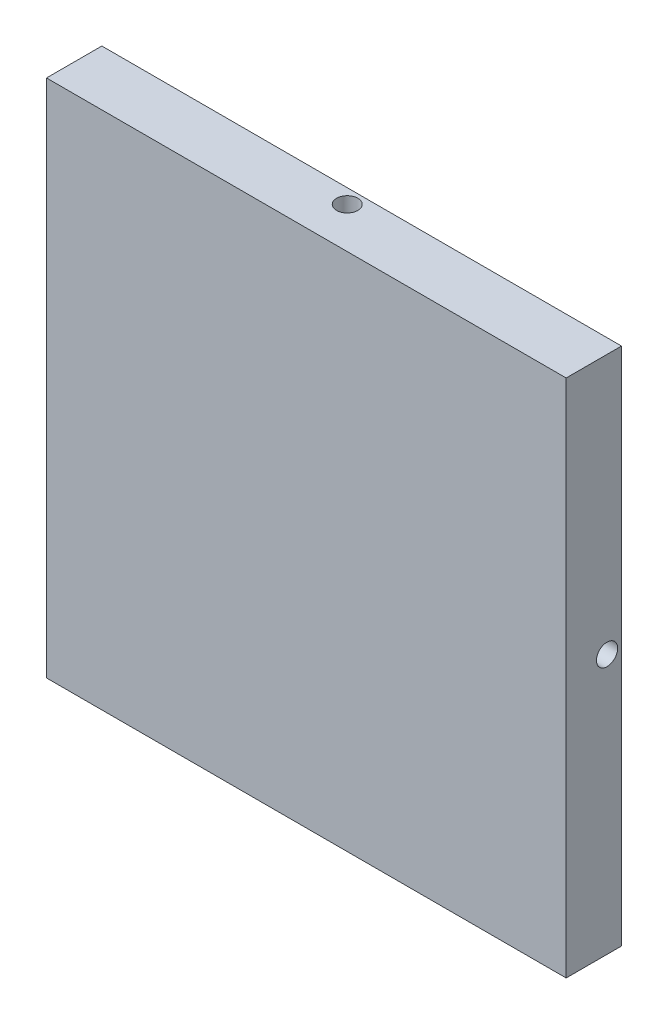
ISO-10303-21;
HEADER;
FILE_DESCRIPTION(('STEP AP214'),'2;1');
FILE_NAME('part.step','',(''),(''),'','','');
FILE_SCHEMA(('AUTOMOTIVE_DESIGN { 1 0 10303 214 1 1 1 1 }'));
ENDSEC;
DATA;
#1=APPLICATION_CONTEXT('core data for automotive mechanical design processes');
#2=APPLICATION_PROTOCOL_DEFINITION('international standard','automotive_design',2000,#1);
#3=PRODUCT_CONTEXT('',#1,'mechanical');
#4=PRODUCT('Part','Part','',(#3));
#5=PRODUCT_RELATED_PRODUCT_CATEGORY('part','',(#4));
#6=PRODUCT_DEFINITION_FORMATION('','',#4);
#7=PRODUCT_DEFINITION_CONTEXT('part definition',#1,'design');
#8=PRODUCT_DEFINITION('design','',#6,#7);
#9=PRODUCT_DEFINITION_SHAPE('','',#8);
#10=(LENGTH_UNIT() NAMED_UNIT(*) SI_UNIT(.MILLI.,.METRE.));
#11=(NAMED_UNIT(*) PLANE_ANGLE_UNIT() SI_UNIT($,.RADIAN.));
#12=(NAMED_UNIT(*) SI_UNIT($,.STERADIAN.) SOLID_ANGLE_UNIT());
#13=UNCERTAINTY_MEASURE_WITH_UNIT(LENGTH_MEASURE(1.E-05),#10,'distance_accuracy_value','');
#14=(GEOMETRIC_REPRESENTATION_CONTEXT(3) GLOBAL_UNCERTAINTY_ASSIGNED_CONTEXT((#13)) GLOBAL_UNIT_ASSIGNED_CONTEXT((#10,
#11,#12)) REPRESENTATION_CONTEXT('',''));
#15=CARTESIAN_POINT('',(0.,0.,0.));
#16=DIRECTION('',(0.,0.,1.));
#17=DIRECTION('',(1.,0.,0.));
#18=AXIS2_PLACEMENT_3D('',#15,#16,#17);
#19=CARTESIAN_POINT('',(0.,0.,0.));
#20=DIRECTION('',(0.,0.,1.));
#21=DIRECTION('',(1.,0.,0.));
#22=AXIS2_PLACEMENT_3D('',#19,#20,#21);
#23=PLANE('',#22);
#24=CARTESIAN_POINT('',(0.,0.,0.));
#25=DIRECTION('',(0.,0.,1.));
#26=DIRECTION('',(1.,0.,0.));
#27=AXIS2_PLACEMENT_3D('',#24,#25,#26);
#28=CIRCLE('',#27,3.3);
#29=CARTESIAN_POINT('',(3.3,0.,0.));
#30=VERTEX_POINT('',#29);
#31=EDGE_CURVE('E229',#30,#30,#28,.T.);
#32=ORIENTED_EDGE('',*,*,#31,.T.);
#33=EDGE_LOOP('',(#32));
#34=FACE_BOUND('',#33,.T.);
#35=CARTESIAN_POINT('',(0.,25.4,0.));
#36=DIRECTION('',(0.,0.,1.));
#37=DIRECTION('',(1.,0.,0.));
#38=AXIS2_PLACEMENT_3D('',#35,#36,#37);
#39=CIRCLE('',#38,1.54305);
#40=CARTESIAN_POINT('',(1.54305,25.4,0.));
#41=VERTEX_POINT('',#40);
#42=EDGE_CURVE('E285',#41,#41,#39,.F.);
#43=ORIENTED_EDGE('',*,*,#42,.F.);
#44=EDGE_LOOP('',(#43));
#45=FACE_BOUND('',#44,.T.);
#46=CARTESIAN_POINT('',(0.,0.,0.));
#47=DIRECTION('',(0.,0.,1.));
#48=DIRECTION('',(1.,0.,0.));
#49=AXIS2_PLACEMENT_3D('',#46,#47,#48);
#50=CIRCLE('',#49,76.99375);
#51=CARTESIAN_POINT('',(76.99375,0.,0.));
#52=VERTEX_POINT('',#51);
#53=EDGE_CURVE('E12',#52,#52,#50,.T.);
#54=ORIENTED_EDGE('',*,*,#53,.F.);
#55=EDGE_LOOP('',(#54));
#56=FACE_BOUND('',#55,.T.);
#57=ADVANCED_FACE('F54',(#34,#45,#56),#23,.F.);
#58=CARTESIAN_POINT('',(85.725,0.,8.73125));
#59=DIRECTION('',(1.,0.,0.));
#60=DIRECTION('',(0.,1.,0.));
#61=AXIS2_PLACEMENT_3D('',#58,#59,#60);
#62=PLANE('',#61);
#63=CARTESIAN_POINT('',(85.725,8.97921713316983E-13,-4.7625));
#64=DIRECTION('',(1.,0.,0.));
#65=DIRECTION('',(0.,0.,1.));
#66=AXIS2_PLACEMENT_3D('',#63,#64,#65);
#67=CIRCLE('',#66,3.5);
#68=CARTESIAN_POINT('',(85.725,8.97921713316983E-13,-1.2625));
#69=VERTEX_POINT('',#68);
#70=EDGE_CURVE('E284',#69,#69,#67,.T.);
#71=ORIENTED_EDGE('',*,*,#70,.F.);
#72=EDGE_LOOP('',(#71));
#73=FACE_BOUND('',#72,.T.);
#74=DIRECTION('',(0.,0.,-1.));
#75=VECTOR('',#74,1.);
#76=CARTESIAN_POINT('',(85.725,-85.725,8.73125));
#77=LINE('',#76,#75);
#78=CARTESIAN_POINT('',(85.725,-85.725,8.73125));
#79=VERTEX_POINT('',#78);
#80=CARTESIAN_POINT('',(85.725,-85.725,-9.525));
#81=VERTEX_POINT('',#80);
#82=EDGE_CURVE('E117',#79,#81,#77,.T.);
#83=ORIENTED_EDGE('',*,*,#82,.T.);
#84=DIRECTION('',(0.,-1.,0.));
#85=VECTOR('',#84,1.);
#86=CARTESIAN_POINT('',(85.725,0.,-9.525));
#87=LINE('',#86,#85);
#88=CARTESIAN_POINT('',(85.725,85.725,-9.525));
#89=VERTEX_POINT('',#88);
#90=EDGE_CURVE('E112',#89,#81,#87,.T.);
#91=ORIENTED_EDGE('',*,*,#90,.F.);
#92=DIRECTION('',(0.,0.,-1.));
#93=VECTOR('',#92,1.);
#94=CARTESIAN_POINT('',(85.725,85.725,8.73125));
#95=LINE('',#94,#93);
#96=CARTESIAN_POINT('',(85.725,85.725,8.73125));
#97=VERTEX_POINT('',#96);
#98=EDGE_CURVE('E96',#97,#89,#95,.T.);
#99=ORIENTED_EDGE('',*,*,#98,.F.);
#100=DIRECTION('',(0.,-1.,0.));
#101=VECTOR('',#100,1.);
#102=CARTESIAN_POINT('',(85.725,0.,8.73125));
#103=LINE('',#102,#101);
#104=EDGE_CURVE('E128',#97,#79,#103,.T.);
#105=ORIENTED_EDGE('',*,*,#104,.T.);
#106=EDGE_LOOP('',(#83,#91,#99,#105));
#107=FACE_BOUND('',#106,.T.);
#108=ADVANCED_FACE('F56',(#73,#107),#62,.T.);
#109=CARTESIAN_POINT('',(0.,85.725,8.73125));
#110=DIRECTION('',(0.,1.,0.));
#111=DIRECTION('',(0.,0.,1.));
#112=AXIS2_PLACEMENT_3D('',#109,#110,#111);
#113=PLANE('',#112);
#114=CARTESIAN_POINT('',(0.,85.725,-4.7625));
#115=DIRECTION('',(0.,1.,0.));
#116=DIRECTION('',(0.,0.,1.));
#117=AXIS2_PLACEMENT_3D('',#114,#115,#116);
#118=CIRCLE('',#117,3.5);
#119=CARTESIAN_POINT('',(0.,85.725,-1.2625));
#120=VERTEX_POINT('',#119);
#121=EDGE_CURVE('E223',#120,#120,#118,.T.);
#122=ORIENTED_EDGE('',*,*,#121,.F.);
#123=EDGE_LOOP('',(#122));
#124=FACE_BOUND('',#123,.T.);
#125=ORIENTED_EDGE('',*,*,#98,.T.);
#126=DIRECTION('',(1.,0.,0.));
#127=VECTOR('',#126,1.);
#128=CARTESIAN_POINT('',(0.,85.725,-9.525));
#129=LINE('',#128,#127);
#130=CARTESIAN_POINT('',(-85.725,85.725,-9.525));
#131=VERTEX_POINT('',#130);
#132=EDGE_CURVE('E99',#131,#89,#129,.T.);
#133=ORIENTED_EDGE('',*,*,#132,.F.);
#134=DIRECTION('',(0.,0.,-1.));
#135=VECTOR('',#134,1.);
#136=CARTESIAN_POINT('',(-85.725,85.725,8.73125));
#137=LINE('',#136,#135);
#138=CARTESIAN_POINT('',(-85.725,85.725,8.73125));
#139=VERTEX_POINT('',#138);
#140=EDGE_CURVE('E106',#139,#131,#137,.T.);
#141=ORIENTED_EDGE('',*,*,#140,.F.);
#142=DIRECTION('',(1.,0.,0.));
#143=VECTOR('',#142,1.);
#144=CARTESIAN_POINT('',(0.,85.725,8.73125));
#145=LINE('',#144,#143);
#146=EDGE_CURVE('E101',#139,#97,#145,.T.);
#147=ORIENTED_EDGE('',*,*,#146,.T.);
#148=EDGE_LOOP('',(#125,#133,#141,#147));
#149=FACE_BOUND('',#148,.T.);
#150=ADVANCED_FACE('F98',(#124,#149),#113,.T.);
#151=CARTESIAN_POINT('',(-85.7250000000003,2.84494650060197E-13,8.73125));
#152=DIRECTION('',(1.,0.,0.));
#153=DIRECTION('',(0.,1.,0.));
#154=AXIS2_PLACEMENT_3D('',#151,#152,#153);
#155=PLANE('',#154);
#156=CARTESIAN_POINT('',(-85.725,-2.99307237772328E-13,-4.7625));
#157=DIRECTION('',(-1.,0.,0.));
#158=DIRECTION('',(0.,0.,1.));
#159=AXIS2_PLACEMENT_3D('',#156,#157,#158);
#160=CIRCLE('',#159,3.5);
#161=CARTESIAN_POINT('',(-85.725,-2.99307237772328E-13,-1.2625));
#162=VERTEX_POINT('',#161);
#163=EDGE_CURVE('E232',#162,#162,#160,.T.);
#164=ORIENTED_EDGE('',*,*,#163,.F.);
#165=EDGE_LOOP('',(#164));
#166=FACE_BOUND('',#165,.T.);
#167=ORIENTED_EDGE('',*,*,#140,.T.);
#168=DIRECTION('',(0.,-1.,0.));
#169=VECTOR('',#168,1.);
#170=CARTESIAN_POINT('',(-85.7250000000003,2.84494650060197E-13,-9.525));
#171=LINE('',#170,#169);
#172=CARTESIAN_POINT('',(-85.7250000000006,-85.725,-9.525));
#173=VERTEX_POINT('',#172);
#174=EDGE_CURVE('E115',#131,#173,#171,.T.);
#175=ORIENTED_EDGE('',*,*,#174,.T.);
#176=DIRECTION('',(0.,0.,-1.));
#177=VECTOR('',#176,1.);
#178=CARTESIAN_POINT('',(-85.7250000000006,-85.725,8.73125));
#179=LINE('',#178,#177);
#180=CARTESIAN_POINT('',(-85.7250000000006,-85.725,8.73125));
#181=VERTEX_POINT('',#180);
#182=EDGE_CURVE('E134',#181,#173,#179,.T.);
#183=ORIENTED_EDGE('',*,*,#182,.F.);
#184=DIRECTION('',(0.,-1.,0.));
#185=VECTOR('',#184,1.);
#186=CARTESIAN_POINT('',(-85.7250000000003,2.84494650060197E-13,8.73125));
#187=LINE('',#186,#185);
#188=EDGE_CURVE('E74',#139,#181,#187,.T.);
#189=ORIENTED_EDGE('',*,*,#188,.F.);
#190=EDGE_LOOP('',(#167,#175,#183,#189));
#191=FACE_BOUND('',#190,.T.);
#192=ADVANCED_FACE('F208',(#166,#191),#155,.F.);
#193=CARTESIAN_POINT('',(0.,-85.725,8.73125));
#194=DIRECTION('',(0.,1.,0.));
#195=DIRECTION('',(0.,0.,1.));
#196=AXIS2_PLACEMENT_3D('',#193,#194,#195);
#197=PLANE('',#196);
#198=CARTESIAN_POINT('',(0.,-85.725,-4.7625));
#199=DIRECTION('',(0.,-1.,0.));
#200=DIRECTION('',(0.,0.,1.));
#201=AXIS2_PLACEMENT_3D('',#198,#199,#200);
#202=CIRCLE('',#201,3.5);
#203=CARTESIAN_POINT('',(0.,-85.725,-1.2625));
#204=VERTEX_POINT('',#203);
#205=EDGE_CURVE('E286',#204,#204,#202,.T.);
#206=ORIENTED_EDGE('',*,*,#205,.F.);
#207=EDGE_LOOP('',(#206));
#208=FACE_BOUND('',#207,.T.);
#209=ORIENTED_EDGE('',*,*,#182,.T.);
#210=DIRECTION('',(1.,0.,0.));
#211=VECTOR('',#210,1.);
#212=CARTESIAN_POINT('',(0.,-85.725,-9.525));
#213=LINE('',#212,#211);
#214=EDGE_CURVE('E126',#173,#81,#213,.T.);
#215=ORIENTED_EDGE('',*,*,#214,.T.);
#216=ORIENTED_EDGE('',*,*,#82,.F.);
#217=DIRECTION('',(1.,0.,0.));
#218=VECTOR('',#217,1.);
#219=CARTESIAN_POINT('',(0.,-85.725,8.73125));
#220=LINE('',#219,#218);
#221=EDGE_CURVE('E69',#181,#79,#220,.T.);
#222=ORIENTED_EDGE('',*,*,#221,.F.);
#223=EDGE_LOOP('',(#209,#215,#216,#222));
#224=FACE_BOUND('',#223,.T.);
#225=ADVANCED_FACE('F201',(#208,#224),#197,.F.);
#226=CARTESIAN_POINT('',(0.,0.,8.73125));
#227=DIRECTION('',(0.,0.,1.));
#228=DIRECTION('',(1.,0.,0.));
#229=AXIS2_PLACEMENT_3D('',#226,#227,#228);
#230=PLANE('',#229);
#231=ORIENTED_EDGE('',*,*,#104,.F.);
#232=ORIENTED_EDGE('',*,*,#146,.F.);
#233=ORIENTED_EDGE('',*,*,#188,.T.);
#234=ORIENTED_EDGE('',*,*,#221,.T.);
#235=EDGE_LOOP('',(#231,#232,#233,#234));
#236=FACE_BOUND('',#235,.T.);
#237=ADVANCED_FACE('F198',(#236),#230,.T.);
#238=CARTESIAN_POINT('',(0.,0.,-9.525));
#239=DIRECTION('',(0.,0.,1.));
#240=DIRECTION('',(1.,0.,0.));
#241=AXIS2_PLACEMENT_3D('',#238,#239,#240);
#242=CYLINDRICAL_SURFACE('',#241,76.99375);
#243=CARTESIAN_POINT('',(-76.914156948266,-3.50000000000027,-4.7625));
#244=CARTESIAN_POINT('',(-76.9141580187678,-3.49999132065777,-4.95898753348253));
#245=CARTESIAN_POINT('',(-76.914917970357,-3.48339842904328,-5.15561495356308));
#246=CARTESIAN_POINT('',(-76.9178762513476,-3.41744053891348,-5.5434470934605));
#247=CARTESIAN_POINT('',(-76.9200762818108,-3.36803678226753,-5.73464512089552));
#248=CARTESIAN_POINT('',(-76.9256649974172,-3.23787318672199,-6.1059441148263));
#249=CARTESIAN_POINT('',(-76.9290530831563,-3.15712915759317,-6.28605062350543));
#250=CARTESIAN_POINT('',(-76.9366353810167,-2.96660089214694,-6.63010408793839));
#251=CARTESIAN_POINT('',(-76.94082940103,-2.85682357406157,-6.79405488061863));
#252=CARTESIAN_POINT('',(-76.9495551280392,-2.61123875971142,-7.10133346968724));
#253=CARTESIAN_POINT('',(-76.9540870860534,-2.47541179380689,-7.24464569954161));
#254=CARTESIAN_POINT('',(-76.9629756362332,-2.18162151370581,-7.50644660473739));
#255=CARTESIAN_POINT('',(-76.9673322212825,-2.0236573023835,-7.62493427356212));
#256=CARTESIAN_POINT('',(-76.9753808755869,-1.68999865833304,-7.8337626694603));
#257=CARTESIAN_POINT('',(-76.9790726683983,-1.51429689689407,-7.92409169855795));
#258=CARTESIAN_POINT('',(-76.9853732270334,-1.15020237514232,-8.0739635019889));
#259=CARTESIAN_POINT('',(-76.9879820000077,-0.961809698631497,-8.13350647958931));
#260=CARTESIAN_POINT('',(-76.9918208811093,-0.577820447894939,-8.22007602564744));
#261=CARTESIAN_POINT('',(-76.9930519500726,-0.382228992684647,-8.247125256811));
#262=CARTESIAN_POINT('',(-76.9939999042288,0.0107219659007974,-8.26800940062272));
#263=CARTESIAN_POINT('',(-76.9937167997468,0.20808145721053,-8.26184453975814));
#264=CARTESIAN_POINT('',(-76.9916691238355,0.598812723737446,-8.21649435614746));
#265=CARTESIAN_POINT('',(-76.9899056472449,0.792187337795512,-8.17733343621612));
#266=CARTESIAN_POINT('',(-76.9850971529962,1.16961512946215,-8.06714058184974));
#267=CARTESIAN_POINT('',(-76.9820521306526,1.35366827298792,-7.99610853089125));
#268=CARTESIAN_POINT('',(-76.9750217106705,1.70730714331206,-7.82416187682907));
#269=CARTESIAN_POINT('',(-76.9710359626899,1.87688744806779,-7.72323613723414));
#270=CARTESIAN_POINT('',(-76.9625730373835,2.1967075836287,-7.49437517197528));
#271=CARTESIAN_POINT('',(-76.9580958572231,2.34694730286256,-7.36643979051026));
#272=CARTESIAN_POINT('',(-76.9491495832638,2.62396380797202,-7.08705315959855));
#273=CARTESIAN_POINT('',(-76.9446805004453,2.7507192438639,-6.93558073996141));
#274=CARTESIAN_POINT('',(-76.9362583307958,2.977004623831,-6.61349422149646));
#275=CARTESIAN_POINT('',(-76.9323052440851,3.07653456155845,-6.44288011820569));
#276=CARTESIAN_POINT('',(-76.9253611502162,3.24554167586348,-6.08734068037587));
#277=CARTESIAN_POINT('',(-76.9223701678044,3.31501807945206,-5.90241497788093));
#278=CARTESIAN_POINT('',(-76.9176885368186,3.42193182865626,-5.52350741286491));
#279=CARTESIAN_POINT('',(-76.9159978801586,3.459369373505,-5.32952560666696));
#280=CARTESIAN_POINT('',(-76.9141090392171,3.50111634276861,-4.93819818067721));
#281=CARTESIAN_POINT('',(-76.913909520574,3.50545538582025,-4.74085572676581));
#282=CARTESIAN_POINT('',(-76.9150219718644,3.48095944627295,-4.34824543875355));
#283=CARTESIAN_POINT('',(-76.9163339376809,3.4521245540365,-4.15297759900311));
#284=CARTESIAN_POINT('',(-76.9203202622321,3.36212381571632,-3.77014251731238));
#285=CARTESIAN_POINT('',(-76.9229940507761,3.30097150042986,-3.58257208797973));
#286=CARTESIAN_POINT('',(-76.9294021609269,3.14808550169469,-3.22035815109461));
#287=CARTESIAN_POINT('',(-76.9331364875908,3.05635167242357,-3.04571470518698));
#288=CARTESIAN_POINT('',(-76.9412480112563,2.84483052236912,-2.71417590418165));
#289=CARTESIAN_POINT('',(-76.9456256636979,2.72502329111081,-2.55729326323335));
#290=CARTESIAN_POINT('',(-76.9545288034614,2.46078535028823,-2.26585723526307));
#291=CARTESIAN_POINT('',(-76.959054291574,2.31635450899468,-2.13130396770448));
#292=CARTESIAN_POINT('',(-76.9677469075859,2.00684208498668,-1.888246801769));
#293=CARTESIAN_POINT('',(-76.971913770996,1.84174547761447,-1.7797620252704));
#294=CARTESIAN_POINT('',(-76.9794157249173,1.49566410231398,-1.59205202793742));
#295=CARTESIAN_POINT('',(-76.9827508185783,1.31467939455605,-1.51282669629951));
#296=CARTESIAN_POINT('',(-76.9882120796731,0.942030702671378,-1.38591798541634));
#297=CARTESIAN_POINT('',(-76.9903387174941,0.750370905728004,-1.33822233216935));
#298=CARTESIAN_POINT('',(-76.9931452505685,0.361753776650363,-1.27568667647134));
#299=CARTESIAN_POINT('',(-76.9938251521148,0.164796467562693,-1.26084653110726));
#300=CARTESIAN_POINT('',(-76.9936616153175,-0.228634767112123,-1.26444456762646));
#301=CARTESIAN_POINT('',(-76.9928195511789,-0.425108968525256,-1.28285272911951));
#302=CARTESIAN_POINT('',(-76.989709606002,-0.812174592205118,-1.35236284824809));
#303=CARTESIAN_POINT('',(-76.9874417222338,-1.00276600320808,-1.40346486847843));
#304=CARTESIAN_POINT('',(-76.9817353674682,-1.3726629202977,-1.53690625592124));
#305=CARTESIAN_POINT('',(-76.9782968840296,-1.55196830641229,-1.61924595512938));
#306=CARTESIAN_POINT('',(-76.970636230119,-1.89421063314168,-1.81281955345898));
#307=CARTESIAN_POINT('',(-76.9664140848621,-2.05714810014709,-1.92405252296302));
#308=CARTESIAN_POINT('',(-76.9576571765792,-2.36217793887485,-2.17236042438191));
#309=CARTESIAN_POINT('',(-76.9531221678774,-2.5042536486436,-2.30945581469399));
#310=CARTESIAN_POINT('',(-76.9442521199401,-2.76341600634497,-2.60559229778808));
#311=CARTESIAN_POINT('',(-76.939917130264,-2.88049648692896,-2.76463879090567));
#312=CARTESIAN_POINT('',(-76.9319335085355,-3.08639024835032,-3.1002706709212));
#313=CARTESIAN_POINT('',(-76.9282854800342,-3.17517871932492,-3.27687127435058));
#314=CARTESIAN_POINT('',(-76.9220970565002,-3.32173976624027,-3.6423562210481));
#315=CARTESIAN_POINT('',(-76.9195553504331,-3.37954907256763,-3.83122571835422));
#316=CARTESIAN_POINT('',(-76.9165409241894,-3.44730473825511,-4.14481172450808));
#317=CARTESIAN_POINT('',(-76.9156508599483,-3.46704033180776,-4.2674958694422));
#318=CARTESIAN_POINT('',(-76.9144585340124,-3.49339069996133,-4.51426806308436));
#319=CARTESIAN_POINT('',(-76.9141562719064,-3.50000548374427,-4.63835611080989));
#320=CARTESIAN_POINT('',(-76.914156948266,-3.50000000000027,-4.7625));
#321=B_SPLINE_CURVE_WITH_KNOTS('',3,(#243,#244,#245,#246,#247,#248,#249,#250,#251,#252,#253,
#254,#255,#256,#257,#258,#259,#260,#261,#262,#263,#264,#265,#266,#267,#268,#269,#270,#271,#272,
#273,#274,#275,#276,#277,#278,#279,#280,#281,#282,#283,#284,#285,#286,#287,#288,#289,#290,#291,
#292,#293,#294,#295,#296,#297,#298,#299,#300,#301,#302,#303,#304,#305,#306,#307,#308,#309,#310,
#311,#312,#313,#314,#315,#316,#317,#318,#319,#320),.UNSPECIFIED.,.T.,.F.,(4,2,2,2,2,2,2,2,2,2,2,
2,2,2,2,2,2,2,2,2,2,2,2,2,2,2,2,2,2,2,2,2,2,2,2,2,2,2,4),(0.,0.589009436150271,1.1787158854926,
1.76812524002841,2.35739427279382,2.94710545681045,3.5368405461571,4.12682030433559,
4.71679616708067,5.30636031286248,5.89592043840481,6.48504492673186,7.07417156896335,
7.66351795902476,8.25286774873554,8.84275072566909,9.43263384013677,10.0225321257334,
10.6124267430305,11.2017934232481,11.7911584980936,12.3802770103085,12.9693983316683,
13.5589387464825,14.1484823152685,14.738457017616,15.3284294857465,15.9181721515313,
16.507912252081,17.0971201336986,17.6863291434017,18.2755444154244,18.8647407322739,
19.4544051006683,20.0442147957289,20.6345402930252,21.2241643147176,21.5963099264451,
21.9684552777422),.UNSPECIFIED.);
#322=CARTESIAN_POINT('',(-76.914156948266,-3.50000000000027,-4.7625));
#323=VERTEX_POINT('',#322);
#324=EDGE_CURVE('E295',#323,#323,#321,.T.);
#325=ORIENTED_EDGE('',*,*,#324,.F.);
#326=EDGE_LOOP('',(#325));
#327=FACE_BOUND('',#326,.T.);
#328=CARTESIAN_POINT('',(0.,-76.99375,-8.2625));
#329=CARTESIAN_POINT('',(-0.196487651769927,-76.9937489336414,-8.26249132076501));
#330=CARTESIAN_POINT('',(-0.39311518973328,-76.9929897876186,-8.24589840984841));
#331=CARTESIAN_POINT('',(-0.780947574573524,-76.9900343843276,-8.17994043607369));
#332=CARTESIAN_POINT('',(-0.972145729160827,-76.9878364275152,-8.13053661548508));
#333=CARTESIAN_POINT('',(-1.3434449918635,-76.98225221267,-8.00037283285575));
#334=CARTESIAN_POINT('',(-1.52355164108511,-76.9788665537458,-7.91962867753443));
#335=CARTESIAN_POINT('',(-1.86760534063254,-76.9712884008879,-7.72910011498888));
#336=CARTESIAN_POINT('',(-2.03155622806305,-76.9670960992393,-7.61932262631008));
#337=CARTESIAN_POINT('',(-2.33883470862715,-76.9583723567241,-7.37373764026799));
#338=CARTESIAN_POINT('',(-2.48214676559997,-76.9538406642368,-7.23791071131443));
#339=CARTESIAN_POINT('',(-2.74394733756454,-76.9449510682711,-6.94412057749942));
#340=CARTESIAN_POINT('',(-2.86243484551011,-76.9405931718489,-6.786156475043));
#341=CARTESIAN_POINT('',(-3.07126307435566,-76.9325408876182,-6.45249792487207));
#342=CARTESIAN_POINT('',(-3.1615920674035,-76.9288467765429,-6.2767961297399));
#343=CARTESIAN_POINT('',(-3.31146379486844,-76.9225415958037,-5.91270153472014));
#344=CARTESIAN_POINT('',(-3.37100673299023,-76.9199305189736,-5.72430881881494));
#345=CARTESIAN_POINT('',(-3.45757619480471,-76.9160880573694,-5.34031945357451));
#346=CARTESIAN_POINT('',(-3.48462537834873,-76.9148557111648,-5.14472792262162));
#347=CARTESIAN_POINT('',(-3.50550940068443,-76.9139067881954,-4.75177681618606));
#348=CARTESIAN_POINT('',(-3.49934446646544,-76.9141902010718,-4.55441725279554));
#349=CARTESIAN_POINT('',(-3.45399416799496,-76.9162399423221,-4.16368631320135));
#350=CARTESIAN_POINT('',(-3.4148332803641,-76.9180051714711,-3.97031208954706));
#351=CARTESIAN_POINT('',(-3.30464062642467,-76.9228178460899,-3.5928850620537));
#352=CARTESIAN_POINT('',(-3.23360874287336,-76.9258652962766,-3.4088322925079));
#353=CARTESIAN_POINT('',(-3.06166243278827,-76.9329001902832,-3.055193870551));
#354=CARTESIAN_POINT('',(-2.96073683026662,-76.9368879855442,-2.88561365941016));
#355=CARTESIAN_POINT('',(-2.73187615615057,-76.9453537243885,-2.5657936526938));
#356=CARTESIAN_POINT('',(-2.60394092884146,-76.9498316707974,-2.41555396862749));
#357=CARTESIAN_POINT('',(-2.32455440571348,-76.9587778671952,-2.13853728462855));
#358=CARTESIAN_POINT('',(-2.17308190863526,-76.9632461047229,-2.01178166593885));
#359=CARTESIAN_POINT('',(-1.85099517066974,-76.9716653349139,-1.78549595428294));
#360=CARTESIAN_POINT('',(-1.68038092557689,-76.9756163274635,-1.68596586729834));
#361=CARTESIAN_POINT('',(-1.32484145268337,-76.9825558970256,-1.51695864618532));
#362=CARTESIAN_POINT('',(-1.13991587914235,-76.9855444507781,-1.4474822383763));
#363=CARTESIAN_POINT('',(-0.761008593916654,-76.9902219620002,-1.34056844106828));
#364=CARTESIAN_POINT('',(-0.567026938339531,-76.9919109275204,-1.30313085309841));
#365=CARTESIAN_POINT('',(-0.175699577059006,-76.9937978691749,-1.26138372173322));
#366=CARTESIAN_POINT('',(0.0216429671507847,-76.993997176501,-1.2570446007354));
#367=CARTESIAN_POINT('',(0.41425345460241,-76.992885870594,-1.28154041663555));
#368=CARTESIAN_POINT('',(0.60952140349428,-76.991575261474,-1.31037526316281));
#369=CARTESIAN_POINT('',(0.992357001011033,-76.9875926211186,-1.40037601936471));
#370=CARTESIAN_POINT('',(1.17992782619126,-76.9849211577311,-1.46152844418228));
#371=CARTESIAN_POINT('',(1.54214250616481,-76.9785176495546,-1.61441479488659));
#372=CARTESIAN_POINT('',(1.7167862995838,-76.9747855997306,-1.706148865956));
#373=CARTESIAN_POINT('',(2.0483253290881,-76.9666775956911,-1.91767036719018));
#374=CARTESIAN_POINT('',(2.20520789028631,-76.9623011867038,-2.03747764630226));
#375=CARTESIAN_POINT('',(2.49664373498858,-76.9533989467459,-2.30171563787195));
#376=CARTESIAN_POINT('',(2.63119689868967,-76.9488731149737,-2.44614648243289));
#377=CARTESIAN_POINT('',(2.87425385197252,-76.9401783745866,-2.75565885942878));
#378=CARTESIAN_POINT('',(2.98273851994399,-76.9360097294066,-2.92075541627084));
#379=CARTESIAN_POINT('',(3.17044832660646,-76.9285035539568,-3.26683666268606));
#380=CARTESIAN_POINT('',(3.24967357609726,-76.9251660205397,-3.44782129209093));
#381=CARTESIAN_POINT('',(3.37658222999273,-76.9197002903658,-3.82047004300681));
#382=CARTESIAN_POINT('',(3.42427787288004,-76.9175716244221,-4.01212998944457));
#383=CARTESIAN_POINT('',(3.4868134571614,-76.9147623399943,-4.4007474328554));
#384=CARTESIAN_POINT('',(3.50165354225943,-76.9140817151768,-4.59770490665426));
#385=CARTESIAN_POINT('',(3.49805533498089,-76.9142454287087,-4.99113602838783));
#386=CARTESIAN_POINT('',(3.47964713467515,-76.9150883881061,-5.18760995282317));
#387=CARTESIAN_POINT('',(3.41013703559858,-76.9182013459072,-5.57467501315918));
#388=CARTESIAN_POINT('',(3.35903507373563,-76.9204713470648,-5.76526613770653));
#389=CARTESIAN_POINT('',(3.22559390549767,-76.9261822319299,-6.13516249853074));
#390=CARTESIAN_POINT('',(3.14325436713979,-76.9296231280813,-6.31446761483992));
#391=CARTESIAN_POINT('',(2.94968117361792,-76.9372878463498,-6.65670946944156));
#392=CARTESIAN_POINT('',(2.83844844778014,-76.9415116432843,-6.81964673395914));
#393=CARTESIAN_POINT('',(2.59014080875463,-76.9502703818598,-7.12467659788702));
#394=CARTESIAN_POINT('',(2.45304538185076,-76.9548055686596,-7.26675249034524));
#395=CARTESIAN_POINT('',(2.1569087511986,-76.9636744105775,-7.52591519948604));
#396=CARTESIAN_POINT('',(1.99786214750964,-76.9680080157553,-7.6429958492899));
#397=CARTESIAN_POINT('',(1.66223018315039,-76.9759879060417,-7.84888978646669));
#398=CARTESIAN_POINT('',(1.48562962561842,-76.9796335875458,-7.93767829608269));
#399=CARTESIAN_POINT('',(1.12014477736413,-76.9858173952855,-8.08423942808179));
#400=CARTESIAN_POINT('',(0.931275332348519,-76.9883568324445,-8.14204878024237));
#401=CARTESIAN_POINT('',(0.617689202938774,-76.9913684248902,-8.20980457916367));
#402=CARTESIAN_POINT('',(0.495004873048069,-76.9922576041775,-8.22954023255729));
#403=CARTESIAN_POINT('',(0.248232308586499,-76.9934487283989,-8.25589068024084));
#404=CARTESIAN_POINT('',(0.124144074994749,-76.9937506737426,-8.26250548368098));
#405=CARTESIAN_POINT('',(0.,-76.99375,-8.2625));
#406=B_SPLINE_CURVE_WITH_KNOTS('',3,(#328,#329,#330,#331,#332,#333,#334,#335,#336,#337,#338,
#339,#340,#341,#342,#343,#344,#345,#346,#347,#348,#349,#350,#351,#352,#353,#354,#355,#356,#357,
#358,#359,#360,#361,#362,#363,#364,#365,#366,#367,#368,#369,#370,#371,#372,#373,#374,#375,#376,
#377,#378,#379,#380,#381,#382,#383,#384,#385,#386,#387,#388,#389,#390,#391,#392,#393,#394,#395,
#396,#397,#398,#399,#400,#401,#402,#403,#404,#405),.UNSPECIFIED.,.T.,.F.,(4,2,2,2,2,2,2,2,2,2,2,
2,2,2,2,2,2,2,2,2,2,2,2,2,2,2,2,2,2,2,2,2,2,2,2,2,2,2,4),(0.,0.589009791392292,1.17871658823794,
1.76812634795735,2.3573957796733,2.94710649899128,3.53684113620523,4.12682106719472,
4.71679709436413,5.30636145644826,5.8959217893827,6.48504516713285,7.07417071208879,
7.66351678458299,8.25286625484211,8.84274969382153,9.4326332624019,10.0225310861407,
10.6124252556133,11.2017922193512,11.7911575775719,12.3802772107008,12.9693996406437,
13.5589398687035,14.148483259696,14.7384577780201,15.328430062201,15.9181732089898,
16.5079137763488,17.0971208538518,17.686329068405,18.2755435450485,18.864739072427,
19.4544039165713,20.0442140763609,20.6345393707559,21.2241632012822,21.5963093695044,
21.9684552781993),.UNSPECIFIED.);
#407=CARTESIAN_POINT('',(0.,-76.99375,-8.2625));
#408=VERTEX_POINT('',#407);
#409=EDGE_CURVE('E289',#408,#408,#406,.T.);
#410=ORIENTED_EDGE('',*,*,#409,.F.);
#411=EDGE_LOOP('',(#410));
#412=FACE_BOUND('',#411,.T.);
#413=CARTESIAN_POINT('',(76.914156948266,3.50000000000081,-4.7625));
#414=CARTESIAN_POINT('',(76.9141580187677,3.49999132065831,-4.95898753348253));
#415=CARTESIAN_POINT('',(76.914917970357,3.48339842904382,-5.15561495356308));
#416=CARTESIAN_POINT('',(76.9178762513476,3.41744053891402,-5.5434470934605));
#417=CARTESIAN_POINT('',(76.9200762818108,3.36803678226807,-5.73464512089552));
#418=CARTESIAN_POINT('',(76.9256649974172,3.23787318672253,-6.1059441148263));
#419=CARTESIAN_POINT('',(76.9290530831563,3.15712915759371,-6.28605062350544));
#420=CARTESIAN_POINT('',(76.9366353810167,2.96660089214748,-6.6301040879384));
#421=CARTESIAN_POINT('',(76.94082940103,2.8568235740621,-6.79405488061863));
#422=CARTESIAN_POINT('',(76.9495551280392,2.61123875971195,-7.10133346968724));
#423=CARTESIAN_POINT('',(76.9540870860534,2.47541179380743,-7.24464569954162));
#424=CARTESIAN_POINT('',(76.9629756362332,2.18162151370635,-7.50644660473739));
#425=CARTESIAN_POINT('',(76.9673322212825,2.02365730238404,-7.62493427356212));
#426=CARTESIAN_POINT('',(76.9753808755869,1.68999865833358,-7.8337626694603));
#427=CARTESIAN_POINT('',(76.9790726683983,1.51429689689461,-7.92409169855795));
#428=CARTESIAN_POINT('',(76.9853732270334,1.15020237514285,-8.0739635019889));
#429=CARTESIAN_POINT('',(76.9879820000077,0.961809698632033,-8.13350647958931));
#430=CARTESIAN_POINT('',(76.9918208811093,0.577820447895476,-8.22007602564744));
#431=CARTESIAN_POINT('',(76.9930519500726,0.382228992685184,-8.247125256811));
#432=CARTESIAN_POINT('',(76.9939999042288,-0.0107219659002607,-8.26800940062272));
#433=CARTESIAN_POINT('',(76.9937167997468,-0.208081457209994,-8.26184453975814));
#434=CARTESIAN_POINT('',(76.9916691238355,-0.59881272373691,-8.21649435614746));
#435=CARTESIAN_POINT('',(76.9899056472449,-0.792187337794976,-8.17733343621612));
#436=CARTESIAN_POINT('',(76.9850971529962,-1.16961512946161,-8.06714058184974));
#437=CARTESIAN_POINT('',(76.9820521306526,-1.35366827298739,-7.99610853089125));
#438=CARTESIAN_POINT('',(76.9750217106705,-1.70730714331152,-7.82416187682907));
#439=CARTESIAN_POINT('',(76.97103596269,-1.87688744806726,-7.72323613723414));
#440=CARTESIAN_POINT('',(76.9625730373836,-2.19670758362817,-7.49437517197527));
#441=CARTESIAN_POINT('',(76.9580958572231,-2.34694730286203,-7.36643979051025));
#442=CARTESIAN_POINT('',(76.9491495832638,-2.62396380797148,-7.08705315959855));
#443=CARTESIAN_POINT('',(76.9446805004453,-2.75071924386336,-6.93558073996141));
#444=CARTESIAN_POINT('',(76.9362583307958,-2.97700462383046,-6.61349422149646));
#445=CARTESIAN_POINT('',(76.9323052440851,-3.07653456155792,-6.44288011820569));
#446=CARTESIAN_POINT('',(76.9253611502163,-3.24554167586294,-6.08734068037587));
#447=CARTESIAN_POINT('',(76.9223701678044,-3.31501807945152,-5.90241497788093));
#448=CARTESIAN_POINT('',(76.9176885368186,-3.42193182865573,-5.52350741286491));
#449=CARTESIAN_POINT('',(76.9159978801587,-3.45936937350447,-5.32952560666696));
#450=CARTESIAN_POINT('',(76.9141090392171,-3.50111634276808,-4.93819818067721));
#451=CARTESIAN_POINT('',(76.913909520574,-3.50545538581971,-4.74085572676581));
#452=CARTESIAN_POINT('',(76.9150219718644,-3.48095944627241,-4.34824543875355));
#453=CARTESIAN_POINT('',(76.9163339376809,-3.45212455403596,-4.15297759900311));
#454=CARTESIAN_POINT('',(76.9203202622321,-3.36212381571578,-3.77014251731237));
#455=CARTESIAN_POINT('',(76.9229940507761,-3.30097150042933,-3.58257208797973));
#456=CARTESIAN_POINT('',(76.929402160927,-3.14808550169416,-3.22035815109461));
#457=CARTESIAN_POINT('',(76.9331364875908,-3.05635167242303,-3.04571470518698));
#458=CARTESIAN_POINT('',(76.9412480112563,-2.84483052236859,-2.71417590418165));
#459=CARTESIAN_POINT('',(76.945625663698,-2.72502329111027,-2.55729326323335));
#460=CARTESIAN_POINT('',(76.9545288034614,-2.46078535028769,-2.26585723526307));
#461=CARTESIAN_POINT('',(76.959054291574,-2.31635450899415,-2.13130396770448));
#462=CARTESIAN_POINT('',(76.9677469075859,-2.00684208498614,-1.88824680176899));
#463=CARTESIAN_POINT('',(76.971913770996,-1.84174547761394,-1.7797620252704));
#464=CARTESIAN_POINT('',(76.9794157249173,-1.49566410231344,-1.59205202793742));
#465=CARTESIAN_POINT('',(76.9827508185783,-1.31467939455552,-1.51282669629951));
#466=CARTESIAN_POINT('',(76.988212079673,-0.942030702670842,-1.38591798541634));
#467=CARTESIAN_POINT('',(76.9903387174941,-0.750370905727468,-1.33822233216935));
#468=CARTESIAN_POINT('',(76.9931452505685,-0.361753776649827,-1.27568667647134));
#469=CARTESIAN_POINT('',(76.9938251521148,-0.164796467562156,-1.26084653110726));
#470=CARTESIAN_POINT('',(76.9936616153175,0.228634767112662,-1.26444456762646));
#471=CARTESIAN_POINT('',(76.9928195511789,0.425108968525794,-1.28285272911951));
#472=CARTESIAN_POINT('',(76.989709606002,0.812174592205656,-1.35236284824809));
#473=CARTESIAN_POINT('',(76.9874417222338,1.00276600320861,-1.40346486847843));
#474=CARTESIAN_POINT('',(76.9817353674682,1.37266292029824,-1.53690625592124));
#475=CARTESIAN_POINT('',(76.9782968840295,1.55196830641283,-1.61924595512938));
#476=CARTESIAN_POINT('',(76.970636230119,1.89421063314222,-1.81281955345898));
#477=CARTESIAN_POINT('',(76.9664140848621,2.05714810014762,-1.92405252296302));
#478=CARTESIAN_POINT('',(76.9576571765792,2.36217793887539,-2.17236042438191));
#479=CARTESIAN_POINT('',(76.9531221678773,2.50425364864414,-2.30945581469399));
#480=CARTESIAN_POINT('',(76.9442521199401,2.76341600634551,-2.60559229778808));
#481=CARTESIAN_POINT('',(76.9399171302639,2.88049648692949,-2.76463879090567));
#482=CARTESIAN_POINT('',(76.9319335085355,3.08639024835086,-3.1002706709212));
#483=CARTESIAN_POINT('',(76.9282854800341,3.17517871932545,-3.27687127435058));
#484=CARTESIAN_POINT('',(76.9220970565001,3.3217397662408,-3.6423562210481));
#485=CARTESIAN_POINT('',(76.9195553504331,3.37954907256817,-3.83122571835422));
#486=CARTESIAN_POINT('',(76.9165409241894,3.44730473825564,-4.14481172450808));
#487=CARTESIAN_POINT('',(76.9156508599482,3.4670403318083,-4.2674958694422));
#488=CARTESIAN_POINT('',(76.9144585340124,3.49339069996187,-4.51426806308436));
#489=CARTESIAN_POINT('',(76.9141562719063,3.50000548374481,-4.63835611080989));
#490=CARTESIAN_POINT('',(76.914156948266,3.50000000000081,-4.7625));
#491=B_SPLINE_CURVE_WITH_KNOTS('',3,(#413,#414,#415,#416,#417,#418,#419,#420,#421,#422,#423,
#424,#425,#426,#427,#428,#429,#430,#431,#432,#433,#434,#435,#436,#437,#438,#439,#440,#441,#442,
#443,#444,#445,#446,#447,#448,#449,#450,#451,#452,#453,#454,#455,#456,#457,#458,#459,#460,#461,
#462,#463,#464,#465,#466,#467,#468,#469,#470,#471,#472,#473,#474,#475,#476,#477,#478,#479,#480,
#481,#482,#483,#484,#485,#486,#487,#488,#489,#490),.UNSPECIFIED.,.T.,.F.,(4,2,2,2,2,2,2,2,2,2,2,
2,2,2,2,2,2,2,2,2,2,2,2,2,2,2,2,2,2,2,2,2,2,2,2,2,2,2,4),(0.,0.589009436150272,1.1787158854926,
1.76812524002841,2.35739427279382,2.94710545681046,3.5368405461571,4.12682030433559,
4.71679616708067,5.30636031286248,5.89592043840482,6.48504492673187,7.07417156896336,
7.66351795902476,8.25286774873555,8.84275072566909,9.43263384013677,10.0225321257334,
10.6124267430305,11.2017934232481,11.7911584980936,12.3802770103085,12.9693983316684,
13.5589387464825,14.1484823152685,14.738457017616,15.3284294857465,15.9181721515313,
16.507912252081,17.0971201336986,17.6863291434017,18.2755444154244,18.8647407322739,
19.4544051006683,20.0442147957289,20.6345402930252,21.2241643147176,21.5963099264451,
21.9684552777422),.UNSPECIFIED.);
#492=CARTESIAN_POINT('',(76.914156948266,3.50000000000081,-4.7625));
#493=VERTEX_POINT('',#492);
#494=EDGE_CURVE('E278',#493,#493,#491,.T.);
#495=ORIENTED_EDGE('',*,*,#494,.F.);
#496=EDGE_LOOP('',(#495));
#497=FACE_BOUND('',#496,.T.);
#498=CARTESIAN_POINT('',(0.,76.99375,-1.2625));
#499=CARTESIAN_POINT('',(-0.196487651769927,76.9937489336414,-1.26250867923499));
#500=CARTESIAN_POINT('',(-0.393115189733279,76.9929897876186,-1.27910159015159));
#501=CARTESIAN_POINT('',(-0.780947574573524,76.9900343843276,-1.34505956392631));
#502=CARTESIAN_POINT('',(-0.972145729160826,76.9878364275152,-1.39446338451492));
#503=CARTESIAN_POINT('',(-1.3434449918635,76.98225221267,-1.52462716714425));
#504=CARTESIAN_POINT('',(-1.52355164108511,76.9788665537458,-1.60537132246557));
#505=CARTESIAN_POINT('',(-1.86760534063254,76.9712884008879,-1.79589988501112));
#506=CARTESIAN_POINT('',(-2.03155622806305,76.9670960992393,-1.90567737368992));
#507=CARTESIAN_POINT('',(-2.33883470862715,76.9583723567241,-2.15126235973201));
#508=CARTESIAN_POINT('',(-2.48214676559997,76.9538406642368,-2.28708928868557));
#509=CARTESIAN_POINT('',(-2.74394733756454,76.9449510682711,-2.58087942250058));
#510=CARTESIAN_POINT('',(-2.86243484551011,76.9405931718489,-2.738843524957));
#511=CARTESIAN_POINT('',(-3.07126307435566,76.9325408876182,-3.07250207512794));
#512=CARTESIAN_POINT('',(-3.1615920674035,76.9288467765429,-3.2482038702601));
#513=CARTESIAN_POINT('',(-3.31146379486844,76.9225415958037,-3.61229846527987));
#514=CARTESIAN_POINT('',(-3.37100673299023,76.9199305189736,-3.80069118118506));
#515=CARTESIAN_POINT('',(-3.45757619480471,76.9160880573694,-4.18468054642549));
#516=CARTESIAN_POINT('',(-3.48462537834873,76.9148557111648,-4.38027207737838));
#517=CARTESIAN_POINT('',(-3.50550940068443,76.9139067881954,-4.77322318381394));
#518=CARTESIAN_POINT('',(-3.49934446646544,76.9141902010718,-4.97058274720446));
#519=CARTESIAN_POINT('',(-3.45399416799496,76.9162399423221,-5.36131368679866));
#520=CARTESIAN_POINT('',(-3.4148332803641,76.9180051714711,-5.55468791045294));
#521=CARTESIAN_POINT('',(-3.30464062642467,76.9228178460899,-5.93211493794631));
#522=CARTESIAN_POINT('',(-3.23360874287336,76.9258652962766,-6.1161677074921));
#523=CARTESIAN_POINT('',(-3.06166243278827,76.9329001902832,-6.469806129449));
#524=CARTESIAN_POINT('',(-2.96073683026662,76.9368879855442,-6.63938634058985));
#525=CARTESIAN_POINT('',(-2.73187615615057,76.9453537243885,-6.9592063473062));
#526=CARTESIAN_POINT('',(-2.60394092884146,76.9498316707974,-7.10944603137251));
#527=CARTESIAN_POINT('',(-2.32455440571348,76.9587778671952,-7.38646271537145));
#528=CARTESIAN_POINT('',(-2.17308190863526,76.9632461047229,-7.51321833406115));
#529=CARTESIAN_POINT('',(-1.85099517066974,76.9716653349139,-7.73950404571706));
#530=CARTESIAN_POINT('',(-1.68038092557689,76.9756163274635,-7.83903413270165));
#531=CARTESIAN_POINT('',(-1.32484145268337,76.9825558970256,-8.00804135381468));
#532=CARTESIAN_POINT('',(-1.13991587914235,76.9855444507781,-8.0775177616237));
#533=CARTESIAN_POINT('',(-0.761008593916653,76.9902219620002,-8.18443155893172));
#534=CARTESIAN_POINT('',(-0.56702693833953,76.9919109275204,-8.22186914690159));
#535=CARTESIAN_POINT('',(-0.175699577059006,76.9937978691749,-8.26361627826678));
#536=CARTESIAN_POINT('',(0.0216429671507853,76.993997176501,-8.2679553992646));
#537=CARTESIAN_POINT('',(0.41425345460241,76.992885870594,-8.24345958336445));
#538=CARTESIAN_POINT('',(0.60952140349428,76.991575261474,-8.21462473683719));
#539=CARTESIAN_POINT('',(0.992357001011033,76.9875926211186,-8.12462398063529));
#540=CARTESIAN_POINT('',(1.17992782619126,76.9849211577311,-8.06347155581772));
#541=CARTESIAN_POINT('',(1.54214250616481,76.9785176495546,-7.91058520511341));
#542=CARTESIAN_POINT('',(1.7167862995838,76.9747855997306,-7.818851134044));
#543=CARTESIAN_POINT('',(2.0483253290881,76.9666775956911,-7.60732963280982));
#544=CARTESIAN_POINT('',(2.20520789028631,76.9623011867038,-7.48752235369774));
#545=CARTESIAN_POINT('',(2.49664373498858,76.9533989467459,-7.22328436212806));
#546=CARTESIAN_POINT('',(2.63119689868967,76.9488731149737,-7.07885351756711));
#547=CARTESIAN_POINT('',(2.87425385197252,76.9401783745866,-6.76934114057122));
#548=CARTESIAN_POINT('',(2.98273851994399,76.9360097294066,-6.60424458372916));
#549=CARTESIAN_POINT('',(3.17044832660645,76.9285035539568,-6.25816333731394));
#550=CARTESIAN_POINT('',(3.24967357609726,76.9251660205397,-6.07717870790907));
#551=CARTESIAN_POINT('',(3.37658222999273,76.9197002903658,-5.70452995699319));
#552=CARTESIAN_POINT('',(3.42427787288005,76.9175716244221,-5.51287001055543));
#553=CARTESIAN_POINT('',(3.4868134571614,76.9147623399943,-5.1242525671446));
#554=CARTESIAN_POINT('',(3.50165354225943,76.9140817151768,-4.92729509334574));
#555=CARTESIAN_POINT('',(3.49805533498089,76.9142454287087,-4.53386397161217));
#556=CARTESIAN_POINT('',(3.47964713467515,76.9150883881061,-4.33739004717683));
#557=CARTESIAN_POINT('',(3.41013703559858,76.9182013459072,-3.95032498684083));
#558=CARTESIAN_POINT('',(3.35903507373563,76.9204713470648,-3.75973386229347));
#559=CARTESIAN_POINT('',(3.22559390549767,76.9261822319299,-3.38983750146926));
#560=CARTESIAN_POINT('',(3.14325436713979,76.9296231280813,-3.21053238516008));
#561=CARTESIAN_POINT('',(2.94968117361792,76.9372878463498,-2.86829053055844));
#562=CARTESIAN_POINT('',(2.83844844778014,76.9415116432843,-2.70535326604086));
#563=CARTESIAN_POINT('',(2.59014080875463,76.9502703818598,-2.40032340211298));
#564=CARTESIAN_POINT('',(2.45304538185076,76.9548055686596,-2.25824750965476));
#565=CARTESIAN_POINT('',(2.1569087511986,76.9636744105775,-1.99908480051396));
#566=CARTESIAN_POINT('',(1.99786214750964,76.9680080157553,-1.8820041507101));
#567=CARTESIAN_POINT('',(1.66223018315039,76.9759879060417,-1.67611021353331));
#568=CARTESIAN_POINT('',(1.48562962561842,76.9796335875458,-1.58732170391731));
#569=CARTESIAN_POINT('',(1.12014477736413,76.9858173952855,-1.44076057191821));
#570=CARTESIAN_POINT('',(0.931275332348519,76.9883568324445,-1.38295121975763));
#571=CARTESIAN_POINT('',(0.617689202938773,76.9913684248902,-1.31519542083633));
#572=CARTESIAN_POINT('',(0.495004873048067,76.9922576041775,-1.2954597674427));
#573=CARTESIAN_POINT('',(0.248232308586497,76.9934487283989,-1.26910931975916));
#574=CARTESIAN_POINT('',(0.124144074994748,76.9937506737426,-1.26249451631902));
#575=CARTESIAN_POINT('',(0.,76.99375,-1.2625));
#576=B_SPLINE_CURVE_WITH_KNOTS('',3,(#498,#499,#500,#501,#502,#503,#504,#505,#506,#507,#508,
#509,#510,#511,#512,#513,#514,#515,#516,#517,#518,#519,#520,#521,#522,#523,#524,#525,#526,#527,
#528,#529,#530,#531,#532,#533,#534,#535,#536,#537,#538,#539,#540,#541,#542,#543,#544,#545,#546,
#547,#548,#549,#550,#551,#552,#553,#554,#555,#556,#557,#558,#559,#560,#561,#562,#563,#564,#565,
#566,#567,#568,#569,#570,#571,#572,#573,#574,#575),.UNSPECIFIED.,.T.,.F.,(4,2,2,2,2,2,2,2,2,2,2,
2,2,2,2,2,2,2,2,2,2,2,2,2,2,2,2,2,2,2,2,2,2,2,2,2,2,2,4),(0.,0.589009791392292,1.17871658823794,
1.76812634795735,2.3573957796733,2.94710649899128,3.53684113620523,4.12682106719472,
4.71679709436413,5.30636145644826,5.8959217893827,6.48504516713285,7.07417071208879,
7.66351678458299,8.25286625484211,8.84274969382153,9.4326332624019,10.0225310861407,
10.6124252556133,11.2017922193512,11.7911575775719,12.3802772107008,12.9693996406437,
13.5589398687035,14.148483259696,14.7384577780201,15.328430062201,15.9181732089898,
16.5079137763488,17.0971208538518,17.686329068405,18.2755435450485,18.8647390724271,
19.4544039165713,20.0442140763609,20.6345393707559,21.2241632012822,21.5963093695044,
21.9684552781993),.UNSPECIFIED.);
#577=CARTESIAN_POINT('',(0.,76.99375,-1.2625));
#578=VERTEX_POINT('',#577);
#579=EDGE_CURVE('E226',#578,#578,#576,.T.);
#580=ORIENTED_EDGE('',*,*,#579,.F.);
#581=EDGE_LOOP('',(#580));
#582=FACE_BOUND('',#581,.T.);
#583=CARTESIAN_POINT('',(0.,0.,-9.525));
#584=DIRECTION('',(0.,0.,1.));
#585=DIRECTION('',(1.,0.,0.));
#586=AXIS2_PLACEMENT_3D('',#583,#584,#585);
#587=CIRCLE('',#586,76.99375);
#588=CARTESIAN_POINT('',(76.99375,0.,-9.525));
#589=VERTEX_POINT('',#588);
#590=EDGE_CURVE('E118',#589,#589,#587,.T.);
#591=ORIENTED_EDGE('',*,*,#590,.F.);
#592=EDGE_LOOP('',(#591));
#593=FACE_BOUND('',#592,.T.);
#594=ORIENTED_EDGE('',*,*,#53,.T.);
#595=EDGE_LOOP('',(#594));
#596=FACE_BOUND('',#595,.T.);
#597=ADVANCED_FACE('F200',(#327,#412,#497,#582,#593,#596),#242,.F.);
#598=CARTESIAN_POINT('',(-73.025,73.025,-9.525));
#599=DIRECTION('',(0.,0.,1.));
#600=DIRECTION('',(1.,0.,0.));
#601=AXIS2_PLACEMENT_3D('',#598,#599,#600);
#602=CYLINDRICAL_SURFACE('',#601,3.175);
#603=CARTESIAN_POINT('',(-73.025,73.025,-9.525));
#604=DIRECTION('',(0.,0.,1.));
#605=DIRECTION('',(1.,0.,0.));
#606=AXIS2_PLACEMENT_3D('',#603,#604,#605);
#607=CIRCLE('',#606,3.175);
#608=CARTESIAN_POINT('',(-69.85,73.025,-9.525));
#609=VERTEX_POINT('',#608);
#610=EDGE_CURVE('E121',#609,#609,#607,.T.);
#611=ORIENTED_EDGE('',*,*,#610,.F.);
#612=EDGE_LOOP('',(#611));
#613=FACE_BOUND('',#612,.T.);
#614=CARTESIAN_POINT('',(-73.025,73.025,0.));
#615=DIRECTION('',(0.,0.,1.));
#616=DIRECTION('',(1.,0.,0.));
#617=AXIS2_PLACEMENT_3D('',#614,#615,#616);
#618=CIRCLE('',#617,3.175);
#619=CARTESIAN_POINT('',(-69.85,73.025,0.));
#620=VERTEX_POINT('',#619);
#621=EDGE_CURVE('E62',#620,#620,#618,.T.);
#622=ORIENTED_EDGE('',*,*,#621,.T.);
#623=EDGE_LOOP('',(#622));
#624=FACE_BOUND('',#623,.T.);
#625=ADVANCED_FACE('F147',(#613,#624),#602,.F.);
#626=CARTESIAN_POINT('',(73.025,73.025,-9.525));
#627=DIRECTION('',(0.,0.,1.));
#628=DIRECTION('',(1.,0.,0.));
#629=AXIS2_PLACEMENT_3D('',#626,#627,#628);
#630=CYLINDRICAL_SURFACE('',#629,3.17499999999998);
#631=CARTESIAN_POINT('',(73.025,73.025,-9.525));
#632=DIRECTION('',(0.,0.,1.));
#633=DIRECTION('',(1.,0.,0.));
#634=AXIS2_PLACEMENT_3D('',#631,#632,#633);
#635=CIRCLE('',#634,3.17499999999998);
#636=CARTESIAN_POINT('',(76.2,73.025,-9.525));
#637=VERTEX_POINT('',#636);
#638=EDGE_CURVE('E248',#637,#637,#635,.T.);
#639=ORIENTED_EDGE('',*,*,#638,.F.);
#640=EDGE_LOOP('',(#639));
#641=FACE_BOUND('',#640,.T.);
#642=CARTESIAN_POINT('',(73.025,73.025,0.));
#643=DIRECTION('',(0.,0.,1.));
#644=DIRECTION('',(1.,0.,0.));
#645=AXIS2_PLACEMENT_3D('',#642,#643,#644);
#646=CIRCLE('',#645,3.17499999999998);
#647=CARTESIAN_POINT('',(76.2,73.025,0.));
#648=VERTEX_POINT('',#647);
#649=EDGE_CURVE('E142',#648,#648,#646,.T.);
#650=ORIENTED_EDGE('',*,*,#649,.T.);
#651=EDGE_LOOP('',(#650));
#652=FACE_BOUND('',#651,.T.);
#653=ADVANCED_FACE('F193',(#641,#652),#630,.F.);
#654=CARTESIAN_POINT('',(73.025,-73.025,-9.525));
#655=DIRECTION('',(0.,0.,1.));
#656=DIRECTION('',(1.,0.,0.));
#657=AXIS2_PLACEMENT_3D('',#654,#655,#656);
#658=CYLINDRICAL_SURFACE('',#657,3.17500000000001);
#659=CARTESIAN_POINT('',(73.025,-73.025,-9.525));
#660=DIRECTION('',(0.,0.,1.));
#661=DIRECTION('',(1.,0.,0.));
#662=AXIS2_PLACEMENT_3D('',#659,#660,#661);
#663=CIRCLE('',#662,3.17500000000001);
#664=CARTESIAN_POINT('',(76.2,-73.025,-9.525));
#665=VERTEX_POINT('',#664);
#666=EDGE_CURVE('E245',#665,#665,#663,.T.);
#667=ORIENTED_EDGE('',*,*,#666,.F.);
#668=EDGE_LOOP('',(#667));
#669=FACE_BOUND('',#668,.T.);
#670=CARTESIAN_POINT('',(73.025,-73.025,0.));
#671=DIRECTION('',(0.,0.,1.));
#672=DIRECTION('',(1.,0.,0.));
#673=AXIS2_PLACEMENT_3D('',#670,#671,#672);
#674=CIRCLE('',#673,3.17500000000001);
#675=CARTESIAN_POINT('',(76.2,-73.025,0.));
#676=VERTEX_POINT('',#675);
#677=EDGE_CURVE('E139',#676,#676,#674,.T.);
#678=ORIENTED_EDGE('',*,*,#677,.T.);
#679=EDGE_LOOP('',(#678));
#680=FACE_BOUND('',#679,.T.);
#681=ADVANCED_FACE('F187',(#669,#680),#658,.F.);
#682=CARTESIAN_POINT('',(-73.025,-73.025,-9.525));
#683=DIRECTION('',(0.,0.,1.));
#684=DIRECTION('',(1.,0.,0.));
#685=AXIS2_PLACEMENT_3D('',#682,#683,#684);
#686=CYLINDRICAL_SURFACE('',#685,3.17499999999998);
#687=CARTESIAN_POINT('',(-73.025,-73.025,-9.525));
#688=DIRECTION('',(0.,0.,1.));
#689=DIRECTION('',(1.,0.,0.));
#690=AXIS2_PLACEMENT_3D('',#687,#688,#689);
#691=CIRCLE('',#690,3.17499999999998);
#692=CARTESIAN_POINT('',(-69.85,-73.025,-9.525));
#693=VERTEX_POINT('',#692);
#694=EDGE_CURVE('E242',#693,#693,#691,.T.);
#695=ORIENTED_EDGE('',*,*,#694,.F.);
#696=EDGE_LOOP('',(#695));
#697=FACE_BOUND('',#696,.T.);
#698=CARTESIAN_POINT('',(-73.025,-73.025,0.));
#699=DIRECTION('',(0.,0.,1.));
#700=DIRECTION('',(1.,0.,0.));
#701=AXIS2_PLACEMENT_3D('',#698,#699,#700);
#702=CIRCLE('',#701,3.17499999999998);
#703=CARTESIAN_POINT('',(-69.85,-73.025,0.));
#704=VERTEX_POINT('',#703);
#705=EDGE_CURVE('E105',#704,#704,#702,.T.);
#706=ORIENTED_EDGE('',*,*,#705,.T.);
#707=EDGE_LOOP('',(#706));
#708=FACE_BOUND('',#707,.T.);
#709=ADVANCED_FACE('F181',(#697,#708),#686,.F.);
#710=CARTESIAN_POINT('',(0.,0.,-9.525));
#711=DIRECTION('',(0.,0.,1.));
#712=DIRECTION('',(1.,0.,0.));
#713=AXIS2_PLACEMENT_3D('',#710,#711,#712);
#714=PLANE('',#713);
#715=ORIENTED_EDGE('',*,*,#694,.T.);
#716=EDGE_LOOP('',(#715));
#717=FACE_BOUND('',#716,.T.);
#718=ORIENTED_EDGE('',*,*,#666,.T.);
#719=EDGE_LOOP('',(#718));
#720=FACE_BOUND('',#719,.T.);
#721=ORIENTED_EDGE('',*,*,#638,.T.);
#722=EDGE_LOOP('',(#721));
#723=FACE_BOUND('',#722,.T.);
#724=ORIENTED_EDGE('',*,*,#610,.T.);
#725=EDGE_LOOP('',(#724));
#726=FACE_BOUND('',#725,.T.);
#727=ORIENTED_EDGE('',*,*,#590,.T.);
#728=EDGE_LOOP('',(#727));
#729=FACE_BOUND('',#728,.T.);
#730=ORIENTED_EDGE('',*,*,#90,.T.);
#731=ORIENTED_EDGE('',*,*,#214,.F.);
#732=ORIENTED_EDGE('',*,*,#174,.F.);
#733=ORIENTED_EDGE('',*,*,#132,.T.);
#734=EDGE_LOOP('',(#730,#731,#732,#733));
#735=FACE_BOUND('',#734,.T.);
#736=ADVANCED_FACE('F110',(#717,#720,#723,#726,#729,#735),#714,.F.);
#737=ORIENTED_EDGE('',*,*,#705,.F.);
#738=EDGE_LOOP('',(#737));
#739=FACE_BOUND('',#738,.T.);
#740=ADVANCED_FACE('F167',(#739),#23,.F.);
#741=ORIENTED_EDGE('',*,*,#677,.F.);
#742=EDGE_LOOP('',(#741));
#743=FACE_BOUND('',#742,.T.);
#744=ADVANCED_FACE('F161',(#743),#23,.F.);
#745=ORIENTED_EDGE('',*,*,#649,.F.);
#746=EDGE_LOOP('',(#745));
#747=FACE_BOUND('',#746,.T.);
#748=ADVANCED_FACE('F152',(#747),#23,.F.);
#749=ORIENTED_EDGE('',*,*,#621,.F.);
#750=EDGE_LOOP('',(#749));
#751=FACE_BOUND('',#750,.T.);
#752=ADVANCED_FACE('F149',(#751),#23,.F.);
#753=CARTESIAN_POINT('',(0.,0.,-9.525));
#754=DIRECTION('',(0.,0.,1.));
#755=DIRECTION('',(1.,0.,0.));
#756=AXIS2_PLACEMENT_3D('',#753,#754,#755);
#757=CYLINDRICAL_SURFACE('',#756,3.3);
#758=ORIENTED_EDGE('',*,*,#31,.F.);
#759=EDGE_LOOP('',(#758));
#760=FACE_BOUND('',#759,.T.);
#761=CARTESIAN_POINT('',(0.,0.,-18.3515));
#762=DIRECTION('',(0.,0.,1.));
#763=DIRECTION('',(1.,0.,0.));
#764=AXIS2_PLACEMENT_3D('',#761,#762,#763);
#765=CIRCLE('',#764,3.3);
#766=CARTESIAN_POINT('',(3.3,0.,-18.3515));
#767=VERTEX_POINT('',#766);
#768=EDGE_CURVE('E225',#767,#767,#765,.T.);
#769=ORIENTED_EDGE('',*,*,#768,.T.);
#770=EDGE_LOOP('',(#769));
#771=FACE_BOUND('',#770,.T.);
#772=ADVANCED_FACE('F151',(#760,#771),#757,.T.);
#773=CARTESIAN_POINT('',(0.,0.,-18.3515));
#774=DIRECTION('',(0.,0.,1.));
#775=DIRECTION('',(1.,0.,0.));
#776=AXIS2_PLACEMENT_3D('',#773,#774,#775);
#777=PLANE('',#776);
#778=ORIENTED_EDGE('',*,*,#768,.F.);
#779=EDGE_LOOP('',(#778));
#780=FACE_BOUND('',#779,.T.);
#781=ADVANCED_FACE('F158',(#780),#777,.F.);
#782=CARTESIAN_POINT('',(0.,-85.726,-4.7625));
#783=DIRECTION('',(0.,1.,0.));
#784=DIRECTION('',(0.,0.,1.));
#785=AXIS2_PLACEMENT_3D('',#782,#783,#784);
#786=CYLINDRICAL_SURFACE('',#785,3.5);
#787=ORIENTED_EDGE('',*,*,#121,.T.);
#788=EDGE_LOOP('',(#787));
#789=FACE_BOUND('',#788,.T.);
#790=ORIENTED_EDGE('',*,*,#579,.T.);
#791=EDGE_LOOP('',(#790));
#792=FACE_BOUND('',#791,.T.);
#793=ADVANCED_FACE('F263',(#789,#792),#786,.F.);
#794=CARTESIAN_POINT('',(-85.7260000000015,-8.97932187761015E-13,-4.7625));
#795=DIRECTION('',(1.,0.,0.));
#796=DIRECTION('',(0.,1.,0.));
#797=AXIS2_PLACEMENT_3D('',#794,#795,#796);
#798=CYLINDRICAL_SURFACE('',#797,3.5);
#799=ORIENTED_EDGE('',*,*,#70,.T.);
#800=EDGE_LOOP('',(#799));
#801=FACE_BOUND('',#800,.T.);
#802=ORIENTED_EDGE('',*,*,#494,.T.);
#803=EDGE_LOOP('',(#802));
#804=FACE_BOUND('',#803,.T.);
#805=ADVANCED_FACE('F267',(#801,#804),#798,.F.);
#806=CARTESIAN_POINT('',(0.,85.726,-4.7625));
#807=DIRECTION('',(0.,-1.,0.));
#808=DIRECTION('',(0.,0.,-1.));
#809=AXIS2_PLACEMENT_3D('',#806,#807,#808);
#810=CYLINDRICAL_SURFACE('',#809,3.5);
#811=ORIENTED_EDGE('',*,*,#205,.T.);
#812=EDGE_LOOP('',(#811));
#813=FACE_BOUND('',#812,.T.);
#814=ORIENTED_EDGE('',*,*,#409,.T.);
#815=EDGE_LOOP('',(#814));
#816=FACE_BOUND('',#815,.T.);
#817=ADVANCED_FACE('F273',(#813,#816),#810,.F.);
#818=CARTESIAN_POINT('',(85.7260000000003,2.99310729253668E-13,-4.7625));
#819=DIRECTION('',(-1.,0.,0.));
#820=DIRECTION('',(0.,-1.,0.));
#821=AXIS2_PLACEMENT_3D('',#818,#819,#820);
#822=CYLINDRICAL_SURFACE('',#821,3.5);
#823=ORIENTED_EDGE('',*,*,#163,.T.);
#824=EDGE_LOOP('',(#823));
#825=FACE_BOUND('',#824,.T.);
#826=ORIENTED_EDGE('',*,*,#324,.T.);
#827=EDGE_LOOP('',(#826));
#828=FACE_BOUND('',#827,.T.);
#829=ADVANCED_FACE('F305',(#825,#828),#822,.F.);
#830=CARTESIAN_POINT('',(0.,25.4,13.0956544748396));
#831=DIRECTION('',(0.,0.,-1.));
#832=DIRECTION('',(-1.,0.,0.));
#833=AXIS2_PLACEMENT_3D('',#830,#831,#832);
#834=CYLINDRICAL_SURFACE('',#833,1.54305);
#835=CARTESIAN_POINT('',(0.,25.4,-9.525));
#836=DIRECTION('',(0.,0.,1.));
#837=DIRECTION('',(1.,0.,0.));
#838=AXIS2_PLACEMENT_3D('',#835,#836,#837);
#839=CIRCLE('',#838,1.54305);
#840=CARTESIAN_POINT('',(1.54305,25.4,-9.525));
#841=VERTEX_POINT('',#840);
#842=EDGE_CURVE('E320',#841,#841,#839,.T.);
#843=ORIENTED_EDGE('',*,*,#842,.T.);
#844=EDGE_LOOP('',(#843));
#845=FACE_BOUND('',#844,.T.);
#846=ORIENTED_EDGE('',*,*,#42,.T.);
#847=EDGE_LOOP('',(#846));
#848=FACE_BOUND('',#847,.T.);
#849=ADVANCED_FACE('F309',(#845,#848),#834,.T.);
#850=CARTESIAN_POINT('',(0.,0.,-9.525));
#851=DIRECTION('',(0.,0.,1.));
#852=DIRECTION('',(1.,0.,0.));
#853=AXIS2_PLACEMENT_3D('',#850,#851,#852);
#854=PLANE('',#853);
#855=ORIENTED_EDGE('',*,*,#842,.F.);
#856=EDGE_LOOP('',(#855));
#857=FACE_BOUND('',#856,.T.);
#858=ADVANCED_FACE('F326',(#857),#854,.F.);
#859=CLOSED_SHELL('',(#57,#108,#150,#192,#225,#237,#597,#625,#653,#681,#709,#736,#740,#744,#748,
#752,#772,#781,#793,#805,#817,#829,#849,#858));
#860=MANIFOLD_SOLID_BREP('B2',#859);
#861=ADVANCED_BREP_SHAPE_REPRESENTATION('',(#18,#860),#14);
#862=SHAPE_DEFINITION_REPRESENTATION(#9,#861);
ENDSEC;
END-ISO-10303-21;
